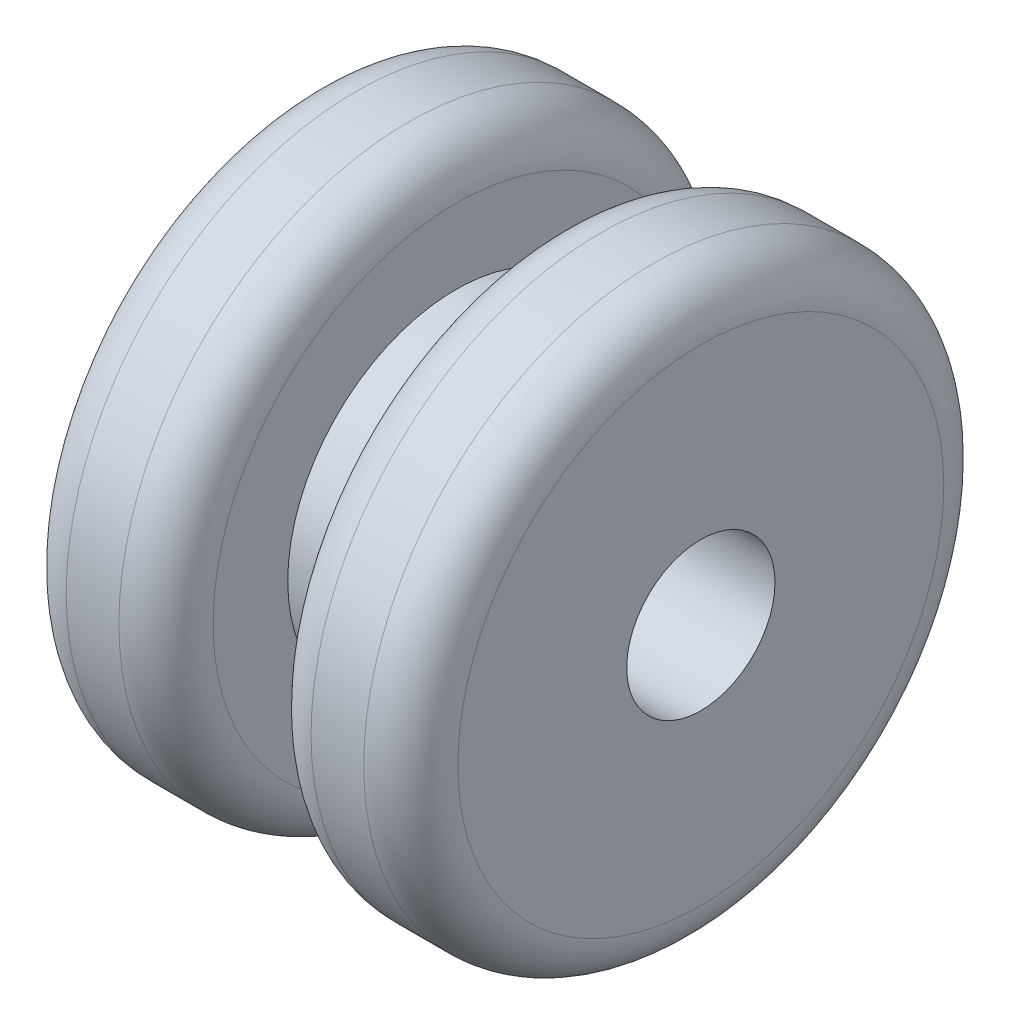
ISO-10303-21;
HEADER;
FILE_DESCRIPTION(('STEP AP214'),'2;1');
FILE_NAME('part.step','',(''),(''),'','','');
FILE_SCHEMA(('AUTOMOTIVE_DESIGN { 1 0 10303 214 1 1 1 1 }'));
ENDSEC;
DATA;
#1=APPLICATION_CONTEXT('core data for automotive mechanical design processes');
#2=APPLICATION_PROTOCOL_DEFINITION('international standard','automotive_design',2000,#1);
#3=PRODUCT_CONTEXT('',#1,'mechanical');
#4=PRODUCT('Part','Part','',(#3));
#5=PRODUCT_RELATED_PRODUCT_CATEGORY('part','',(#4));
#6=PRODUCT_DEFINITION_FORMATION('','',#4);
#7=PRODUCT_DEFINITION_CONTEXT('part definition',#1,'design');
#8=PRODUCT_DEFINITION('design','',#6,#7);
#9=PRODUCT_DEFINITION_SHAPE('','',#8);
#10=(LENGTH_UNIT() NAMED_UNIT(*) SI_UNIT(.MILLI.,.METRE.));
#11=(NAMED_UNIT(*) PLANE_ANGLE_UNIT() SI_UNIT($,.RADIAN.));
#12=(NAMED_UNIT(*) SI_UNIT($,.STERADIAN.) SOLID_ANGLE_UNIT());
#13=UNCERTAINTY_MEASURE_WITH_UNIT(LENGTH_MEASURE(1.E-05),#10,'distance_accuracy_value','');
#14=(GEOMETRIC_REPRESENTATION_CONTEXT(3) GLOBAL_UNCERTAINTY_ASSIGNED_CONTEXT((#13)) GLOBAL_UNIT_ASSIGNED_CONTEXT((#10,
#11,#12)) REPRESENTATION_CONTEXT('',''));
#15=CARTESIAN_POINT('',(0.,0.,0.));
#16=DIRECTION('',(0.,0.,1.));
#17=DIRECTION('',(1.,0.,0.));
#18=AXIS2_PLACEMENT_3D('',#15,#16,#17);
#19=CARTESIAN_POINT('',(6.604,0.,0.));
#20=DIRECTION('',(-1.,0.,0.));
#21=DIRECTION('',(0.,0.,1.));
#22=AXIS2_PLACEMENT_3D('',#19,#20,#21);
#23=CYLINDRICAL_SURFACE('',#22,9.779);
#24=CARTESIAN_POINT('',(-3.2385,0.,0.));
#25=DIRECTION('',(1.,0.,0.));
#26=DIRECTION('',(0.,0.,-1.));
#27=AXIS2_PLACEMENT_3D('',#24,#25,#26);
#28=CIRCLE('',#27,9.779);
#29=CARTESIAN_POINT('',(-3.2385,0.,-9.779));
#30=VERTEX_POINT('',#29);
#31=EDGE_CURVE('E38',#30,#30,#28,.F.);
#32=ORIENTED_EDGE('',*,*,#31,.T.);
#33=EDGE_LOOP('',(#32));
#34=FACE_BOUND('',#33,.T.);
#35=CARTESIAN_POINT('',(-5.0165,0.,0.));
#36=DIRECTION('',(1.,0.,0.));
#37=DIRECTION('',(0.,0.,-1.));
#38=AXIS2_PLACEMENT_3D('',#35,#36,#37);
#39=CIRCLE('',#38,9.779);
#40=CARTESIAN_POINT('',(-5.0165,0.,-9.779));
#41=VERTEX_POINT('',#40);
#42=EDGE_CURVE('E42',#41,#41,#39,.T.);
#43=ORIENTED_EDGE('',*,*,#42,.T.);
#44=EDGE_LOOP('',(#43));
#45=FACE_BOUND('',#44,.T.);
#46=ADVANCED_FACE('F31',(#34,#45),#23,.T.);
#47=CARTESIAN_POINT('',(6.604,0.,0.));
#48=DIRECTION('',(1.,0.,0.));
#49=DIRECTION('',(0.,0.,-1.));
#50=AXIS2_PLACEMENT_3D('',#47,#48,#49);
#51=PLANE('',#50);
#52=CARTESIAN_POINT('',(6.604,0.,0.));
#53=DIRECTION('',(1.,0.,0.));
#54=DIRECTION('',(0.,0.,-1.));
#55=AXIS2_PLACEMENT_3D('',#52,#53,#54);
#56=CIRCLE('',#55,8.1915);
#57=CARTESIAN_POINT('',(6.604,0.,-8.1915));
#58=VERTEX_POINT('',#57);
#59=EDGE_CURVE('E60',#58,#58,#56,.T.);
#60=ORIENTED_EDGE('',*,*,#59,.T.);
#61=EDGE_LOOP('',(#60));
#62=FACE_BOUND('',#61,.T.);
#63=CARTESIAN_POINT('',(6.604,0.,0.));
#64=DIRECTION('',(1.,0.,0.));
#65=DIRECTION('',(0.,0.,-1.));
#66=AXIS2_PLACEMENT_3D('',#63,#64,#65);
#67=CIRCLE('',#66,2.5);
#68=CARTESIAN_POINT('',(6.604,0.,-2.5));
#69=VERTEX_POINT('',#68);
#70=EDGE_CURVE('E63',#69,#69,#67,.T.);
#71=ORIENTED_EDGE('',*,*,#70,.F.);
#72=EDGE_LOOP('',(#71));
#73=FACE_BOUND('',#72,.T.);
#74=ADVANCED_FACE('F96',(#62,#73),#51,.T.);
#75=CARTESIAN_POINT('',(-6.604,0.,0.));
#76=DIRECTION('',(1.,0.,0.));
#77=DIRECTION('',(0.,0.,-1.));
#78=AXIS2_PLACEMENT_3D('',#75,#76,#77);
#79=PLANE('',#78);
#80=CARTESIAN_POINT('',(-6.604,0.,0.));
#81=DIRECTION('',(1.,0.,0.));
#82=DIRECTION('',(0.,0.,-1.));
#83=AXIS2_PLACEMENT_3D('',#80,#81,#82);
#84=CIRCLE('',#83,8.1915);
#85=CARTESIAN_POINT('',(-6.604,0.,-8.1915));
#86=VERTEX_POINT('',#85);
#87=EDGE_CURVE('E10',#86,#86,#84,.F.);
#88=ORIENTED_EDGE('',*,*,#87,.T.);
#89=EDGE_LOOP('',(#88));
#90=FACE_BOUND('',#89,.T.);
#91=CARTESIAN_POINT('',(-6.604,0.,0.));
#92=DIRECTION('',(1.,0.,0.));
#93=DIRECTION('',(0.,0.,-1.));
#94=AXIS2_PLACEMENT_3D('',#91,#92,#93);
#95=CIRCLE('',#94,2.5);
#96=CARTESIAN_POINT('',(-6.604,0.,-2.5));
#97=VERTEX_POINT('',#96);
#98=EDGE_CURVE('E64',#97,#97,#95,.T.);
#99=ORIENTED_EDGE('',*,*,#98,.T.);
#100=EDGE_LOOP('',(#99));
#101=FACE_BOUND('',#100,.T.);
#102=ADVANCED_FACE('F101',(#90,#101),#79,.F.);
#103=CARTESIAN_POINT('',(5.0165,0.,0.));
#104=DIRECTION('',(1.,0.,0.));
#105=DIRECTION('',(0.,0.,-1.));
#106=AXIS2_PLACEMENT_3D('',#103,#104,#105);
#107=CIRCLE('',#106,9.779);
#108=CARTESIAN_POINT('',(5.0165,0.,-9.779));
#109=VERTEX_POINT('',#108);
#110=EDGE_CURVE('E54',#109,#109,#107,.F.);
#111=ORIENTED_EDGE('',*,*,#110,.T.);
#112=EDGE_LOOP('',(#111));
#113=FACE_BOUND('',#112,.T.);
#114=CARTESIAN_POINT('',(3.2385,0.,0.));
#115=DIRECTION('',(1.,0.,0.));
#116=DIRECTION('',(0.,0.,-1.));
#117=AXIS2_PLACEMENT_3D('',#114,#115,#116);
#118=CIRCLE('',#117,9.779);
#119=CARTESIAN_POINT('',(3.2385,0.,-9.779));
#120=VERTEX_POINT('',#119);
#121=EDGE_CURVE('E57',#120,#120,#118,.T.);
#122=ORIENTED_EDGE('',*,*,#121,.T.);
#123=EDGE_LOOP('',(#122));
#124=FACE_BOUND('',#123,.T.);
#125=ADVANCED_FACE('F91',(#113,#124),#23,.T.);
#126=CARTESIAN_POINT('',(6.604,0.,0.));
#127=DIRECTION('',(-1.,0.,0.));
#128=DIRECTION('',(0.,0.,1.));
#129=AXIS2_PLACEMENT_3D('',#126,#127,#128);
#130=CYLINDRICAL_SURFACE('',#129,2.5);
#131=ORIENTED_EDGE('',*,*,#70,.T.);
#132=EDGE_LOOP('',(#131));
#133=FACE_BOUND('',#132,.T.);
#134=ORIENTED_EDGE('',*,*,#98,.F.);
#135=EDGE_LOOP('',(#134));
#136=FACE_BOUND('',#135,.T.);
#137=ADVANCED_FACE('F82',(#133,#136),#130,.F.);
#138=CARTESIAN_POINT('',(-1.651,0.,0.));
#139=DIRECTION('',(1.,0.,0.));
#140=DIRECTION('',(0.,0.,-1.));
#141=AXIS2_PLACEMENT_3D('',#138,#139,#140);
#142=PLANE('',#141);
#143=CARTESIAN_POINT('',(-1.651,0.,0.));
#144=DIRECTION('',(1.,0.,0.));
#145=DIRECTION('',(0.,0.,-1.));
#146=AXIS2_PLACEMENT_3D('',#143,#144,#145);
#147=CIRCLE('',#146,8.1915);
#148=CARTESIAN_POINT('',(-1.651,0.,-8.1915));
#149=VERTEX_POINT('',#148);
#150=EDGE_CURVE('E46',#149,#149,#147,.T.);
#151=ORIENTED_EDGE('',*,*,#150,.T.);
#152=EDGE_LOOP('',(#151));
#153=FACE_BOUND('',#152,.T.);
#154=CARTESIAN_POINT('',(-1.651,0.,0.));
#155=DIRECTION('',(1.,0.,0.));
#156=DIRECTION('',(0.,0.,-1.));
#157=AXIS2_PLACEMENT_3D('',#154,#155,#156);
#158=CIRCLE('',#157,5.675);
#159=CARTESIAN_POINT('',(-1.651,0.,-5.675));
#160=VERTEX_POINT('',#159);
#161=EDGE_CURVE('E67',#160,#160,#158,.T.);
#162=ORIENTED_EDGE('',*,*,#161,.F.);
#163=EDGE_LOOP('',(#162));
#164=FACE_BOUND('',#163,.T.);
#165=ADVANCED_FACE('F79',(#153,#164),#142,.T.);
#166=CARTESIAN_POINT('',(1.651,0.,0.));
#167=DIRECTION('',(1.,0.,0.));
#168=DIRECTION('',(0.,0.,-1.));
#169=AXIS2_PLACEMENT_3D('',#166,#167,#168);
#170=PLANE('',#169);
#171=CARTESIAN_POINT('',(1.651,0.,0.));
#172=DIRECTION('',(1.,0.,0.));
#173=DIRECTION('',(0.,0.,-1.));
#174=AXIS2_PLACEMENT_3D('',#171,#172,#173);
#175=CIRCLE('',#174,8.1915);
#176=CARTESIAN_POINT('',(1.651,0.,-8.1915));
#177=VERTEX_POINT('',#176);
#178=EDGE_CURVE('E51',#177,#177,#175,.F.);
#179=ORIENTED_EDGE('',*,*,#178,.T.);
#180=EDGE_LOOP('',(#179));
#181=FACE_BOUND('',#180,.T.);
#182=CARTESIAN_POINT('',(1.651,0.,0.));
#183=DIRECTION('',(1.,0.,0.));
#184=DIRECTION('',(0.,0.,-1.));
#185=AXIS2_PLACEMENT_3D('',#182,#183,#184);
#186=CIRCLE('',#185,5.675);
#187=CARTESIAN_POINT('',(1.651,0.,-5.675));
#188=VERTEX_POINT('',#187);
#189=EDGE_CURVE('E70',#188,#188,#186,.T.);
#190=ORIENTED_EDGE('',*,*,#189,.T.);
#191=EDGE_LOOP('',(#190));
#192=FACE_BOUND('',#191,.T.);
#193=ADVANCED_FACE('F81',(#181,#192),#170,.F.);
#194=CARTESIAN_POINT('',(-1.651,0.,0.));
#195=DIRECTION('',(1.,0.,0.));
#196=DIRECTION('',(0.,0.,-1.));
#197=AXIS2_PLACEMENT_3D('',#194,#195,#196);
#198=CYLINDRICAL_SURFACE('',#197,5.675);
#199=ORIENTED_EDGE('',*,*,#161,.T.);
#200=EDGE_LOOP('',(#199));
#201=FACE_BOUND('',#200,.T.);
#202=ORIENTED_EDGE('',*,*,#189,.F.);
#203=EDGE_LOOP('',(#202));
#204=FACE_BOUND('',#203,.T.);
#205=ADVANCED_FACE('F76',(#201,#204),#198,.T.);
#206=CARTESIAN_POINT('',(5.0165,0.,0.));
#207=DIRECTION('',(1.,0.,0.));
#208=DIRECTION('',(0.,0.,-1.));
#209=AXIS2_PLACEMENT_3D('',#206,#207,#208);
#210=TOROIDAL_SURFACE('',#209,8.1915,1.5875);
#211=ORIENTED_EDGE('',*,*,#110,.F.);
#212=EDGE_LOOP('',(#211));
#213=FACE_BOUND('',#212,.T.);
#214=ORIENTED_EDGE('',*,*,#59,.F.);
#215=EDGE_LOOP('',(#214));
#216=FACE_BOUND('',#215,.T.);
#217=ADVANCED_FACE('F119',(#213,#216),#210,.T.);
#218=CARTESIAN_POINT('',(3.2385,0.,0.));
#219=DIRECTION('',(1.,0.,0.));
#220=DIRECTION('',(0.,0.,-1.));
#221=AXIS2_PLACEMENT_3D('',#218,#219,#220);
#222=TOROIDAL_SURFACE('',#221,8.1915,1.5875);
#223=ORIENTED_EDGE('',*,*,#178,.F.);
#224=EDGE_LOOP('',(#223));
#225=FACE_BOUND('',#224,.T.);
#226=ORIENTED_EDGE('',*,*,#121,.F.);
#227=EDGE_LOOP('',(#226));
#228=FACE_BOUND('',#227,.T.);
#229=ADVANCED_FACE('F116',(#225,#228),#222,.T.);
#230=CARTESIAN_POINT('',(-3.2385,0.,0.));
#231=DIRECTION('',(1.,0.,0.));
#232=DIRECTION('',(0.,0.,-1.));
#233=AXIS2_PLACEMENT_3D('',#230,#231,#232);
#234=TOROIDAL_SURFACE('',#233,8.1915,1.5875);
#235=ORIENTED_EDGE('',*,*,#31,.F.);
#236=EDGE_LOOP('',(#235));
#237=FACE_BOUND('',#236,.T.);
#238=ORIENTED_EDGE('',*,*,#150,.F.);
#239=EDGE_LOOP('',(#238));
#240=FACE_BOUND('',#239,.T.);
#241=ADVANCED_FACE('F118',(#237,#240),#234,.T.);
#242=CARTESIAN_POINT('',(-5.0165,0.,0.));
#243=DIRECTION('',(1.,0.,0.));
#244=DIRECTION('',(0.,0.,-1.));
#245=AXIS2_PLACEMENT_3D('',#242,#243,#244);
#246=TOROIDAL_SURFACE('',#245,8.1915,1.5875);
#247=ORIENTED_EDGE('',*,*,#87,.F.);
#248=EDGE_LOOP('',(#247));
#249=FACE_BOUND('',#248,.T.);
#250=ORIENTED_EDGE('',*,*,#42,.F.);
#251=EDGE_LOOP('',(#250));
#252=FACE_BOUND('',#251,.T.);
#253=ADVANCED_FACE('F33',(#249,#252),#246,.T.);
#254=CLOSED_SHELL('',(#46,#74,#102,#125,#137,#165,#193,#205,#217,#229,#241,#253));
#255=MANIFOLD_SOLID_BREP('B2',#254);
#256=ADVANCED_BREP_SHAPE_REPRESENTATION('',(#18,#255),#14);
#257=SHAPE_DEFINITION_REPRESENTATION(#9,#256);
ENDSEC;
END-ISO-10303-21;
